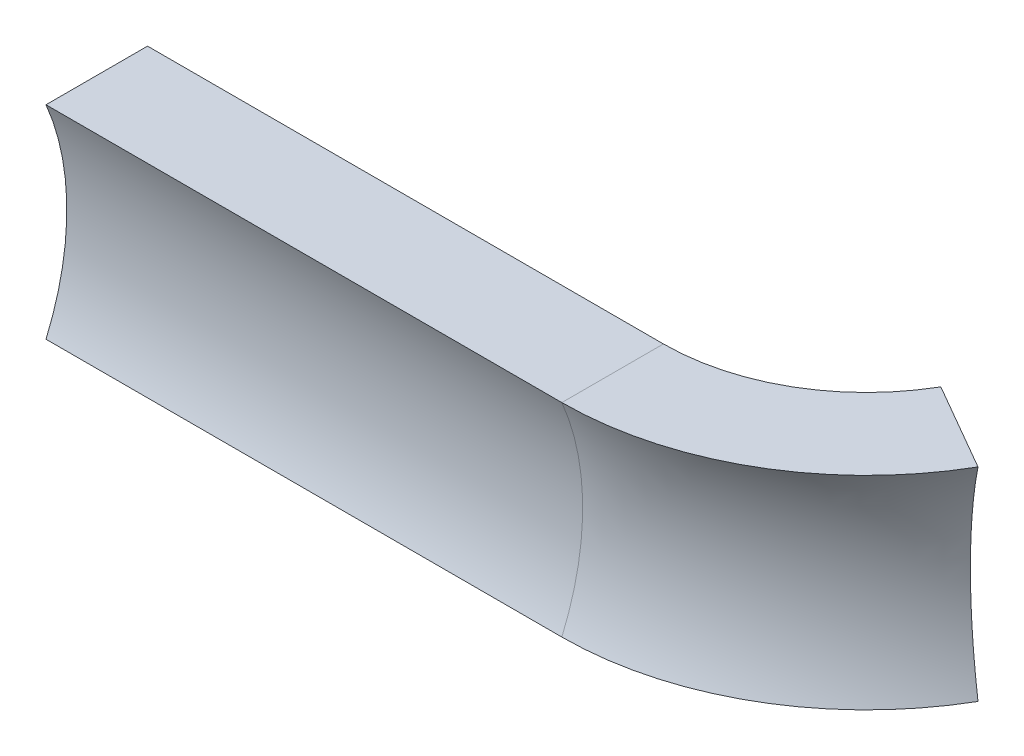
ISO-10303-21;
HEADER;
FILE_DESCRIPTION(('STEP AP214'),'2;1');
FILE_NAME('part.step','',(''),(''),'','','');
FILE_SCHEMA(('AUTOMOTIVE_DESIGN { 1 0 10303 214 1 1 1 1 }'));
ENDSEC;
DATA;
#1=APPLICATION_CONTEXT('core data for automotive mechanical design processes');
#2=APPLICATION_PROTOCOL_DEFINITION('international standard','automotive_design',2000,#1);
#3=PRODUCT_CONTEXT('',#1,'mechanical');
#4=PRODUCT('Part','Part','',(#3));
#5=PRODUCT_RELATED_PRODUCT_CATEGORY('part','',(#4));
#6=PRODUCT_DEFINITION_FORMATION('','',#4);
#7=PRODUCT_DEFINITION_CONTEXT('part definition',#1,'design');
#8=PRODUCT_DEFINITION('design','',#6,#7);
#9=PRODUCT_DEFINITION_SHAPE('','',#8);
#10=(LENGTH_UNIT() NAMED_UNIT(*) SI_UNIT(.MILLI.,.METRE.));
#11=(NAMED_UNIT(*) PLANE_ANGLE_UNIT() SI_UNIT($,.RADIAN.));
#12=(NAMED_UNIT(*) SI_UNIT($,.STERADIAN.) SOLID_ANGLE_UNIT());
#13=UNCERTAINTY_MEASURE_WITH_UNIT(LENGTH_MEASURE(1.E-05),#10,'distance_accuracy_value','');
#14=(GEOMETRIC_REPRESENTATION_CONTEXT(3) GLOBAL_UNCERTAINTY_ASSIGNED_CONTEXT((#13)) GLOBAL_UNIT_ASSIGNED_CONTEXT((#10,
#11,#12)) REPRESENTATION_CONTEXT('',''));
#15=CARTESIAN_POINT('',(0.,0.,0.));
#16=DIRECTION('',(0.,0.,1.));
#17=DIRECTION('',(1.,0.,0.));
#18=AXIS2_PLACEMENT_3D('',#15,#16,#17);
#19=CARTESIAN_POINT('',(0.,0.,16.6743308159397));
#20=DIRECTION('',(-1.,0.,0.));
#21=DIRECTION('',(0.,0.,1.));
#22=AXIS2_PLACEMENT_3D('',#19,#20,#21);
#23=PLANE('',#22);
#24=DIRECTION('',(0.,0.,1.));
#25=VECTOR('',#24,1.);
#26=CARTESIAN_POINT('',(0.,5.,0.));
#27=LINE('',#26,#25);
#28=CARTESIAN_POINT('',(0.,5.,0.));
#29=VERTEX_POINT('',#28);
#30=CARTESIAN_POINT('',(0.,5.,5.));
#31=VERTEX_POINT('',#30);
#32=EDGE_CURVE('E99',#29,#31,#27,.T.);
#33=ORIENTED_EDGE('',*,*,#32,.F.);
#34=DIRECTION('',(0.,1.,0.));
#35=VECTOR('',#34,1.);
#36=CARTESIAN_POINT('',(0.,5.,0.));
#37=LINE('',#36,#35);
#38=CARTESIAN_POINT('',(0.,-5.,0.));
#39=VERTEX_POINT('',#38);
#40=EDGE_CURVE('E101',#39,#29,#37,.T.);
#41=ORIENTED_EDGE('',*,*,#40,.F.);
#42=DIRECTION('',(0.,0.,-1.));
#43=VECTOR('',#42,1.);
#44=CARTESIAN_POINT('',(0.,-5.,0.));
#45=LINE('',#44,#43);
#46=CARTESIAN_POINT('',(0.,-5.,5.));
#47=VERTEX_POINT('',#46);
#48=EDGE_CURVE('E92',#47,#39,#45,.T.);
#49=ORIENTED_EDGE('',*,*,#48,.F.);
#50=CARTESIAN_POINT('',(0.,0.,16.6743308159397));
#51=DIRECTION('',(-1.,0.,0.));
#52=DIRECTION('',(0.,0.,1.));
#53=AXIS2_PLACEMENT_3D('',#50,#51,#52);
#54=CIRCLE('',#53,12.7);
#55=EDGE_CURVE('E96',#31,#47,#54,.T.);
#56=ORIENTED_EDGE('',*,*,#55,.F.);
#57=EDGE_LOOP('',(#33,#41,#49,#56));
#58=FACE_BOUND('',#57,.T.);
#59=ADVANCED_FACE('F33',(#58),#23,.T.);
#60=CARTESIAN_POINT('',(48.5006481155539,0.,3.3371654079698));
#61=DIRECTION('',(-0.499999999999998,0.,0.86602540378444));
#62=DIRECTION('',(0.86602540378444,0.,0.499999999999998));
#63=AXIS2_PLACEMENT_3D('',#60,#61,#62);
#64=PLANE('',#63);
#65=DIRECTION('',(0.86602540378444,0.,0.499999999999998));
#66=VECTOR('',#65,1.);
#67=CARTESIAN_POINT('',(34.0602540378444,5.,-5.00000000000002));
#68=LINE('',#67,#66);
#69=CARTESIAN_POINT('',(34.0602540378444,5.,-5.00000000000003));
#70=VERTEX_POINT('',#69);
#71=CARTESIAN_POINT('',(38.3903810567666,5.,-2.50000000000004));
#72=VERTEX_POINT('',#71);
#73=EDGE_CURVE('E124',#70,#72,#68,.T.);
#74=ORIENTED_EDGE('',*,*,#73,.T.);
#75=CARTESIAN_POINT('',(48.5006481155539,0.,3.3371654079698));
#76=DIRECTION('',(-0.499999999999998,0.,0.86602540378444));
#77=DIRECTION('',(0.86602540378444,0.,0.499999999999998));
#78=AXIS2_PLACEMENT_3D('',#75,#76,#77);
#79=CIRCLE('',#78,12.7);
#80=CARTESIAN_POINT('',(38.3903810567666,-5.,-2.50000000000004));
#81=VERTEX_POINT('',#80);
#82=EDGE_CURVE('E52',#72,#81,#79,.T.);
#83=ORIENTED_EDGE('',*,*,#82,.T.);
#84=DIRECTION('',(-0.86602540378444,0.,-0.499999999999998));
#85=VECTOR('',#84,1.);
#86=CARTESIAN_POINT('',(34.0602540378444,-5.,-5.00000000000002));
#87=LINE('',#86,#85);
#88=CARTESIAN_POINT('',(34.0602540378444,-5.,-5.00000000000003));
#89=VERTEX_POINT('',#88);
#90=EDGE_CURVE('E46',#81,#89,#87,.T.);
#91=ORIENTED_EDGE('',*,*,#90,.T.);
#92=DIRECTION('',(0.,1.,0.));
#93=VECTOR('',#92,1.);
#94=CARTESIAN_POINT('',(34.0602540378444,5.,-5.00000000000002));
#95=LINE('',#94,#93);
#96=EDGE_CURVE('E11',#89,#70,#95,.T.);
#97=ORIENTED_EDGE('',*,*,#96,.T.);
#98=EDGE_LOOP('',(#74,#83,#91,#97));
#99=FACE_BOUND('',#98,.T.);
#100=ADVANCED_FACE('F155',(#99),#64,.F.);
#101=CARTESIAN_POINT('',(0.,5.,0.));
#102=DIRECTION('',(0.,1.,0.));
#103=DIRECTION('',(0.,0.,1.));
#104=AXIS2_PLACEMENT_3D('',#101,#102,#103);
#105=PLANE('',#104);
#106=DIRECTION('',(1.,0.,0.));
#107=VECTOR('',#106,1.);
#108=CARTESIAN_POINT('',(0.,5.,5.));
#109=LINE('',#108,#107);
#110=CARTESIAN_POINT('',(25.4,5.,5.));
#111=VERTEX_POINT('',#110);
#112=EDGE_CURVE('E120',#31,#111,#109,.T.);
#113=ORIENTED_EDGE('',*,*,#112,.T.);
#114=DIRECTION('',(0.,0.,1.));
#115=VECTOR('',#114,1.);
#116=CARTESIAN_POINT('',(25.4,5.,0.));
#117=LINE('',#116,#115);
#118=CARTESIAN_POINT('',(25.4,5.,0.));
#119=VERTEX_POINT('',#118);
#120=EDGE_CURVE('E118',#119,#111,#117,.T.);
#121=ORIENTED_EDGE('',*,*,#120,.F.);
#122=DIRECTION('',(1.,0.,0.));
#123=VECTOR('',#122,1.);
#124=CARTESIAN_POINT('',(0.,5.,0.));
#125=LINE('',#124,#123);
#126=EDGE_CURVE('E111',#29,#119,#125,.T.);
#127=ORIENTED_EDGE('',*,*,#126,.F.);
#128=ORIENTED_EDGE('',*,*,#32,.T.);
#129=EDGE_LOOP('',(#113,#121,#127,#128));
#130=FACE_BOUND('',#129,.T.);
#131=ADVANCED_FACE('F116',(#130),#105,.T.);
#132=CARTESIAN_POINT('',(0.,0.,16.6743308159397));
#133=DIRECTION('',(1.,0.,0.));
#134=DIRECTION('',(0.,0.,-1.));
#135=AXIS2_PLACEMENT_3D('',#132,#133,#134);
#136=CYLINDRICAL_SURFACE('',#135,12.7);
#137=DIRECTION('',(1.,0.,0.));
#138=VECTOR('',#137,1.);
#139=CARTESIAN_POINT('',(0.,-5.,5.));
#140=LINE('',#139,#138);
#141=CARTESIAN_POINT('',(25.4,-5.,5.));
#142=VERTEX_POINT('',#141);
#143=EDGE_CURVE('E134',#47,#142,#140,.T.);
#144=ORIENTED_EDGE('',*,*,#143,.T.);
#145=CARTESIAN_POINT('',(25.4,0.,16.6743308159397));
#146=DIRECTION('',(-1.,0.,0.));
#147=DIRECTION('',(0.,0.,1.));
#148=AXIS2_PLACEMENT_3D('',#145,#146,#147);
#149=CIRCLE('',#148,12.7);
#150=EDGE_CURVE('E132',#111,#142,#149,.T.);
#151=ORIENTED_EDGE('',*,*,#150,.F.);
#152=ORIENTED_EDGE('',*,*,#112,.F.);
#153=ORIENTED_EDGE('',*,*,#55,.T.);
#154=EDGE_LOOP('',(#144,#151,#152,#153));
#155=FACE_BOUND('',#154,.T.);
#156=ADVANCED_FACE('F151',(#155),#136,.F.);
#157=CARTESIAN_POINT('',(0.,-5.,0.));
#158=DIRECTION('',(0.,-1.,0.));
#159=DIRECTION('',(0.,0.,-1.));
#160=AXIS2_PLACEMENT_3D('',#157,#158,#159);
#161=PLANE('',#160);
#162=DIRECTION('',(1.,0.,0.));
#163=VECTOR('',#162,1.);
#164=CARTESIAN_POINT('',(0.,-5.,0.));
#165=LINE('',#164,#163);
#166=CARTESIAN_POINT('',(25.4,-5.,0.));
#167=VERTEX_POINT('',#166);
#168=EDGE_CURVE('E113',#39,#167,#165,.T.);
#169=ORIENTED_EDGE('',*,*,#168,.T.);
#170=DIRECTION('',(0.,0.,-1.));
#171=VECTOR('',#170,1.);
#172=CARTESIAN_POINT('',(25.4,-5.,0.));
#173=LINE('',#172,#171);
#174=EDGE_CURVE('E137',#142,#167,#173,.T.);
#175=ORIENTED_EDGE('',*,*,#174,.F.);
#176=ORIENTED_EDGE('',*,*,#143,.F.);
#177=ORIENTED_EDGE('',*,*,#48,.T.);
#178=EDGE_LOOP('',(#169,#175,#176,#177));
#179=FACE_BOUND('',#178,.T.);
#180=ADVANCED_FACE('F146',(#179),#161,.T.);
#181=CARTESIAN_POINT('',(0.,5.,0.));
#182=DIRECTION('',(0.,0.,-1.));
#183=DIRECTION('',(-1.,0.,0.));
#184=AXIS2_PLACEMENT_3D('',#181,#182,#183);
#185=PLANE('',#184);
#186=DIRECTION('',(0.,1.,0.));
#187=VECTOR('',#186,1.);
#188=CARTESIAN_POINT('',(25.4,5.,0.));
#189=LINE('',#188,#187);
#190=EDGE_CURVE('E130',#167,#119,#189,.T.);
#191=ORIENTED_EDGE('',*,*,#190,.F.);
#192=ORIENTED_EDGE('',*,*,#168,.F.);
#193=ORIENTED_EDGE('',*,*,#40,.T.);
#194=ORIENTED_EDGE('',*,*,#126,.T.);
#195=EDGE_LOOP('',(#191,#192,#193,#194));
#196=FACE_BOUND('',#195,.T.);
#197=ADVANCED_FACE('F110',(#196),#185,.T.);
#198=CARTESIAN_POINT('',(25.4,5.,0.));
#199=DIRECTION('',(0.,1.,0.));
#200=DIRECTION('',(0.,0.,1.));
#201=AXIS2_PLACEMENT_3D('',#198,#199,#200);
#202=PLANE('',#201);
#203=CARTESIAN_POINT('',(25.4,5.,-10.));
#204=DIRECTION('',(0.,1.,0.));
#205=DIRECTION('',(0.,0.,1.));
#206=AXIS2_PLACEMENT_3D('',#203,#204,#205);
#207=CIRCLE('',#206,15.);
#208=EDGE_CURVE('E82',#111,#72,#207,.T.);
#209=ORIENTED_EDGE('',*,*,#208,.T.);
#210=ORIENTED_EDGE('',*,*,#73,.F.);
#211=CARTESIAN_POINT('',(25.4,5.,-10.));
#212=DIRECTION('',(0.,1.,0.));
#213=DIRECTION('',(0.,0.,1.));
#214=AXIS2_PLACEMENT_3D('',#211,#212,#213);
#215=CIRCLE('',#214,10.);
#216=EDGE_CURVE('E126',#119,#70,#215,.T.);
#217=ORIENTED_EDGE('',*,*,#216,.F.);
#218=ORIENTED_EDGE('',*,*,#120,.T.);
#219=EDGE_LOOP('',(#209,#210,#217,#218));
#220=FACE_BOUND('',#219,.T.);
#221=ADVANCED_FACE('F153',(#220),#202,.T.);
#222=CARTESIAN_POINT('',(25.4,0.,-10.));
#223=DIRECTION('',(0.,1.,0.));
#224=DIRECTION('',(0.,0.,1.));
#225=AXIS2_PLACEMENT_3D('',#222,#223,#224);
#226=TOROIDAL_SURFACE('',#225,26.6743308159397,12.7);
#227=CARTESIAN_POINT('',(25.4,-5.,-10.));
#228=DIRECTION('',(0.,1.,0.));
#229=DIRECTION('',(0.,0.,1.));
#230=AXIS2_PLACEMENT_3D('',#227,#228,#229);
#231=CIRCLE('',#230,15.);
#232=EDGE_CURVE('E75',#142,#81,#231,.T.);
#233=ORIENTED_EDGE('',*,*,#232,.T.);
#234=ORIENTED_EDGE('',*,*,#82,.F.);
#235=ORIENTED_EDGE('',*,*,#208,.F.);
#236=ORIENTED_EDGE('',*,*,#150,.T.);
#237=EDGE_LOOP('',(#233,#234,#235,#236));
#238=FACE_BOUND('',#237,.T.);
#239=ADVANCED_FACE('F149',(#238),#226,.F.);
#240=CARTESIAN_POINT('',(25.4,-5.,0.));
#241=DIRECTION('',(0.,-1.,0.));
#242=DIRECTION('',(0.,0.,-1.));
#243=AXIS2_PLACEMENT_3D('',#240,#241,#242);
#244=PLANE('',#243);
#245=CARTESIAN_POINT('',(25.4,-5.,-10.));
#246=DIRECTION('',(0.,1.,0.));
#247=DIRECTION('',(0.,0.,1.));
#248=AXIS2_PLACEMENT_3D('',#245,#246,#247);
#249=CIRCLE('',#248,10.);
#250=EDGE_CURVE('E40',#167,#89,#249,.T.);
#251=ORIENTED_EDGE('',*,*,#250,.T.);
#252=ORIENTED_EDGE('',*,*,#90,.F.);
#253=ORIENTED_EDGE('',*,*,#232,.F.);
#254=ORIENTED_EDGE('',*,*,#174,.T.);
#255=EDGE_LOOP('',(#251,#252,#253,#254));
#256=FACE_BOUND('',#255,.T.);
#257=ADVANCED_FACE('F148',(#256),#244,.T.);
#258=CARTESIAN_POINT('',(25.4,0.,-10.));
#259=DIRECTION('',(0.,1.,0.));
#260=DIRECTION('',(0.,0.,1.));
#261=AXIS2_PLACEMENT_3D('',#258,#259,#260);
#262=CYLINDRICAL_SURFACE('',#261,10.);
#263=ORIENTED_EDGE('',*,*,#96,.F.);
#264=ORIENTED_EDGE('',*,*,#250,.F.);
#265=ORIENTED_EDGE('',*,*,#190,.T.);
#266=ORIENTED_EDGE('',*,*,#216,.T.);
#267=EDGE_LOOP('',(#263,#264,#265,#266));
#268=FACE_BOUND('',#267,.T.);
#269=ADVANCED_FACE('F144',(#268),#262,.F.);
#270=CLOSED_SHELL('',(#59,#100,#131,#156,#180,#197,#221,#239,#257,#269));
#271=MANIFOLD_SOLID_BREP('B2',#270);
#272=ADVANCED_BREP_SHAPE_REPRESENTATION('',(#18,#271),#14);
#273=SHAPE_DEFINITION_REPRESENTATION(#9,#272);
ENDSEC;
END-ISO-10303-21;
